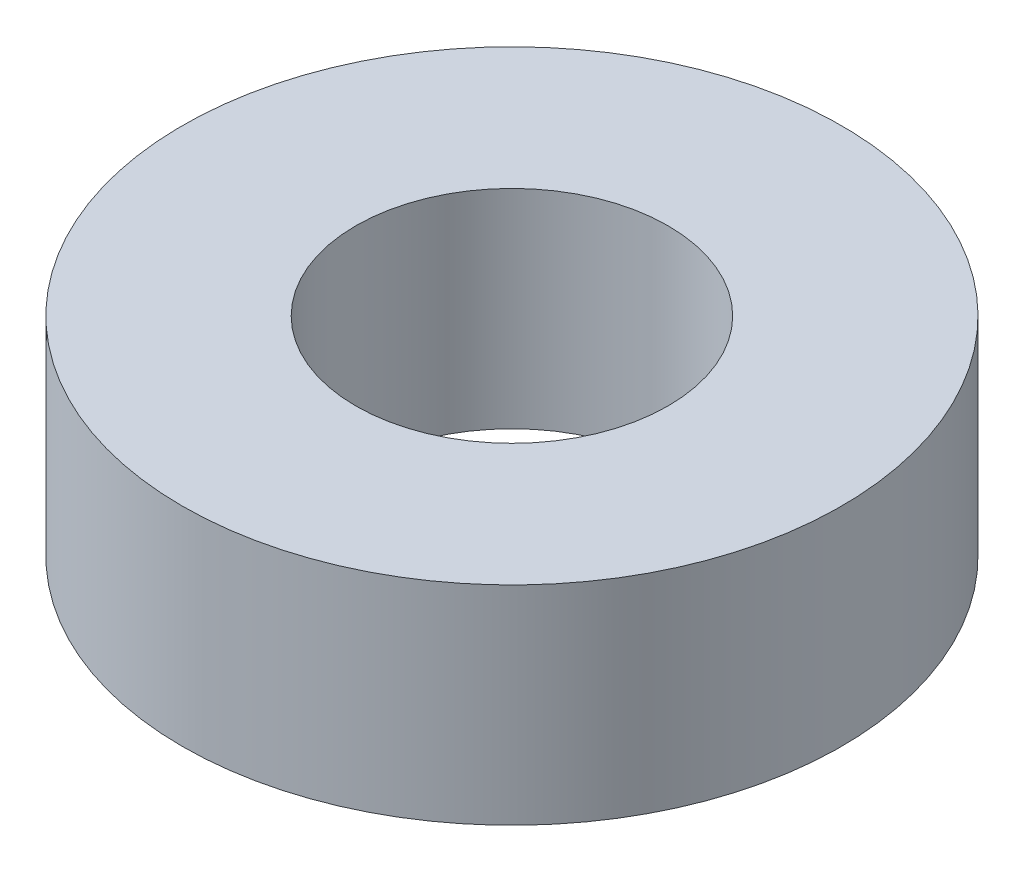
ISO-10303-21;
HEADER;
FILE_DESCRIPTION(('STEP AP214'),'2;1');
FILE_NAME('part.step','',(''),(''),'','','');
FILE_SCHEMA(('AUTOMOTIVE_DESIGN { 1 0 10303 214 1 1 1 1 }'));
ENDSEC;
DATA;
#1=APPLICATION_CONTEXT('core data for automotive mechanical design processes');
#2=APPLICATION_PROTOCOL_DEFINITION('international standard','automotive_design',2000,#1);
#3=PRODUCT_CONTEXT('',#1,'mechanical');
#4=PRODUCT('Part','Part','',(#3));
#5=PRODUCT_RELATED_PRODUCT_CATEGORY('part','',(#4));
#6=PRODUCT_DEFINITION_FORMATION('','',#4);
#7=PRODUCT_DEFINITION_CONTEXT('part definition',#1,'design');
#8=PRODUCT_DEFINITION('design','',#6,#7);
#9=PRODUCT_DEFINITION_SHAPE('','',#8);
#10=(LENGTH_UNIT() NAMED_UNIT(*) SI_UNIT(.MILLI.,.METRE.));
#11=(NAMED_UNIT(*) PLANE_ANGLE_UNIT() SI_UNIT($,.RADIAN.));
#12=(NAMED_UNIT(*) SI_UNIT($,.STERADIAN.) SOLID_ANGLE_UNIT());
#13=UNCERTAINTY_MEASURE_WITH_UNIT(LENGTH_MEASURE(1.E-05),#10,'distance_accuracy_value','');
#14=(GEOMETRIC_REPRESENTATION_CONTEXT(3) GLOBAL_UNCERTAINTY_ASSIGNED_CONTEXT((#13)) GLOBAL_UNIT_ASSIGNED_CONTEXT((#10,
#11,#12)) REPRESENTATION_CONTEXT('',''));
#15=CARTESIAN_POINT('',(0.,0.,0.));
#16=DIRECTION('',(0.,0.,1.));
#17=DIRECTION('',(1.,0.,0.));
#18=AXIS2_PLACEMENT_3D('',#15,#16,#17);
#19=CARTESIAN_POINT('',(0.,30.,0.));
#20=DIRECTION('',(0.,-1.,0.));
#21=DIRECTION('',(0.,0.,-1.));
#22=AXIS2_PLACEMENT_3D('',#19,#20,#21);
#23=CYLINDRICAL_SURFACE('',#22,47.5);
#24=CARTESIAN_POINT('',(0.,30.,0.));
#25=DIRECTION('',(0.,1.,0.));
#26=DIRECTION('',(0.,0.,1.));
#27=AXIS2_PLACEMENT_3D('',#24,#25,#26);
#28=CIRCLE('',#27,47.5);
#29=CARTESIAN_POINT('',(0.,30.,47.5));
#30=VERTEX_POINT('',#29);
#31=EDGE_CURVE('E10',#30,#30,#28,.T.);
#32=ORIENTED_EDGE('',*,*,#31,.F.);
#33=EDGE_LOOP('',(#32));
#34=FACE_BOUND('',#33,.T.);
#35=CARTESIAN_POINT('',(0.,0.,0.));
#36=DIRECTION('',(0.,1.,0.));
#37=DIRECTION('',(0.,0.,1.));
#38=AXIS2_PLACEMENT_3D('',#35,#36,#37);
#39=CIRCLE('',#38,47.5);
#40=CARTESIAN_POINT('',(0.,0.,47.5));
#41=VERTEX_POINT('',#40);
#42=EDGE_CURVE('E37',#41,#41,#39,.T.);
#43=ORIENTED_EDGE('',*,*,#42,.T.);
#44=EDGE_LOOP('',(#43));
#45=FACE_BOUND('',#44,.T.);
#46=ADVANCED_FACE('F40',(#34,#45),#23,.T.);
#47=CARTESIAN_POINT('',(0.,30.,0.));
#48=DIRECTION('',(0.,1.,0.));
#49=DIRECTION('',(0.,0.,1.));
#50=AXIS2_PLACEMENT_3D('',#47,#48,#49);
#51=PLANE('',#50);
#52=CARTESIAN_POINT('',(0.,30.,0.));
#53=DIRECTION('',(0.,1.,0.));
#54=DIRECTION('',(0.,0.,1.));
#55=AXIS2_PLACEMENT_3D('',#52,#53,#54);
#56=CIRCLE('',#55,22.5);
#57=CARTESIAN_POINT('',(0.,30.,22.5));
#58=VERTEX_POINT('',#57);
#59=EDGE_CURVE('E50',#58,#58,#56,.T.);
#60=ORIENTED_EDGE('',*,*,#59,.F.);
#61=EDGE_LOOP('',(#60));
#62=FACE_BOUND('',#61,.T.);
#63=ORIENTED_EDGE('',*,*,#31,.T.);
#64=EDGE_LOOP('',(#63));
#65=FACE_BOUND('',#64,.T.);
#66=ADVANCED_FACE('F59',(#62,#65),#51,.T.);
#67=CARTESIAN_POINT('',(0.,0.,0.));
#68=DIRECTION('',(0.,1.,0.));
#69=DIRECTION('',(0.,0.,1.));
#70=AXIS2_PLACEMENT_3D('',#67,#68,#69);
#71=PLANE('',#70);
#72=CARTESIAN_POINT('',(0.,0.,0.));
#73=DIRECTION('',(0.,1.,0.));
#74=DIRECTION('',(0.,0.,1.));
#75=AXIS2_PLACEMENT_3D('',#72,#73,#74);
#76=CIRCLE('',#75,22.5);
#77=CARTESIAN_POINT('',(0.,0.,22.5));
#78=VERTEX_POINT('',#77);
#79=EDGE_CURVE('E47',#78,#78,#76,.T.);
#80=ORIENTED_EDGE('',*,*,#79,.T.);
#81=EDGE_LOOP('',(#80));
#82=FACE_BOUND('',#81,.T.);
#83=ORIENTED_EDGE('',*,*,#42,.F.);
#84=EDGE_LOOP('',(#83));
#85=FACE_BOUND('',#84,.T.);
#86=ADVANCED_FACE('F58',(#82,#85),#71,.F.);
#87=CARTESIAN_POINT('',(0.,30.,0.));
#88=DIRECTION('',(0.,-1.,0.));
#89=DIRECTION('',(0.,0.,-1.));
#90=AXIS2_PLACEMENT_3D('',#87,#88,#89);
#91=CYLINDRICAL_SURFACE('',#90,22.5);
#92=ORIENTED_EDGE('',*,*,#59,.T.);
#93=EDGE_LOOP('',(#92));
#94=FACE_BOUND('',#93,.T.);
#95=ORIENTED_EDGE('',*,*,#79,.F.);
#96=EDGE_LOOP('',(#95));
#97=FACE_BOUND('',#96,.T.);
#98=ADVANCED_FACE('F54',(#94,#97),#91,.F.);
#99=CLOSED_SHELL('',(#46,#66,#86,#98));
#100=MANIFOLD_SOLID_BREP('B2',#99);
#101=ADVANCED_BREP_SHAPE_REPRESENTATION('',(#18,#100),#14);
#102=SHAPE_DEFINITION_REPRESENTATION(#9,#101);
ENDSEC;
END-ISO-10303-21;
